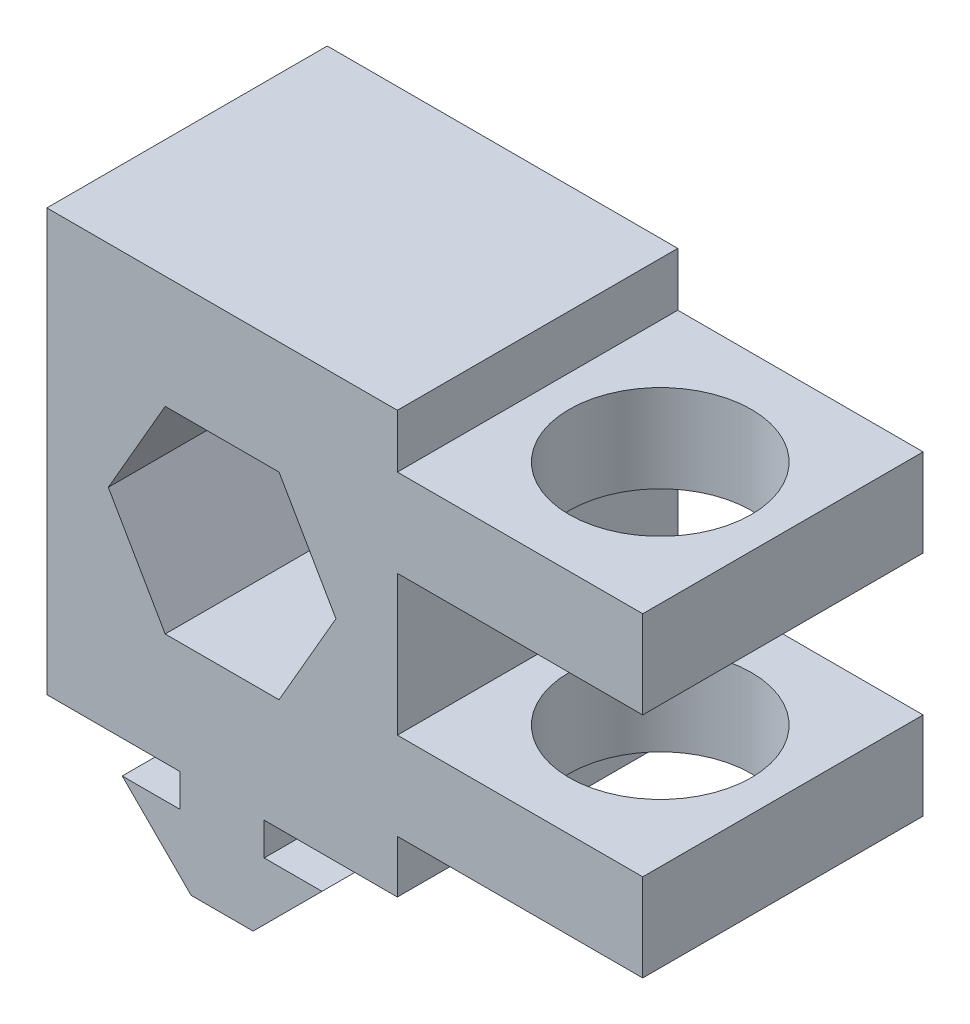
ISO-10303-21;
HEADER;
FILE_DESCRIPTION(('STEP AP214'),'2;1');
FILE_NAME('part.step','',(''),(''),'','','');
FILE_SCHEMA(('AUTOMOTIVE_DESIGN { 1 0 10303 214 1 1 1 1 }'));
ENDSEC;
DATA;
#1=APPLICATION_CONTEXT('core data for automotive mechanical design processes');
#2=APPLICATION_PROTOCOL_DEFINITION('international standard','automotive_design',2000,#1);
#3=PRODUCT_CONTEXT('',#1,'mechanical');
#4=PRODUCT('Part','Part','',(#3));
#5=PRODUCT_RELATED_PRODUCT_CATEGORY('part','',(#4));
#6=PRODUCT_DEFINITION_FORMATION('','',#4);
#7=PRODUCT_DEFINITION_CONTEXT('part definition',#1,'design');
#8=PRODUCT_DEFINITION('design','',#6,#7);
#9=PRODUCT_DEFINITION_SHAPE('','',#8);
#10=(LENGTH_UNIT() NAMED_UNIT(*) SI_UNIT(.MILLI.,.METRE.));
#11=(NAMED_UNIT(*) PLANE_ANGLE_UNIT() SI_UNIT($,.RADIAN.));
#12=(NAMED_UNIT(*) SI_UNIT($,.STERADIAN.) SOLID_ANGLE_UNIT());
#13=UNCERTAINTY_MEASURE_WITH_UNIT(LENGTH_MEASURE(1.E-05),#10,'distance_accuracy_value','');
#14=(GEOMETRIC_REPRESENTATION_CONTEXT(3) GLOBAL_UNCERTAINTY_ASSIGNED_CONTEXT((#13)) GLOBAL_UNIT_ASSIGNED_CONTEXT((#10,
#11,#12)) REPRESENTATION_CONTEXT('',''));
#15=CARTESIAN_POINT('',(0.,0.,0.));
#16=DIRECTION('',(0.,0.,1.));
#17=DIRECTION('',(1.,0.,0.));
#18=AXIS2_PLACEMENT_3D('',#15,#16,#17);
#19=CARTESIAN_POINT('',(0.,0.,10.16));
#20=DIRECTION('',(0.,0.,-1.));
#21=DIRECTION('',(-1.,0.,0.));
#22=AXIS2_PLACEMENT_3D('',#19,#20,#21);
#23=PLANE('',#22);
#24=DIRECTION('',(-1.,0.,0.));
#25=VECTOR('',#24,1.);
#26=CARTESIAN_POINT('',(7.239,4.99364,10.16));
#27=LINE('',#26,#25);
#28=CARTESIAN_POINT('',(7.239,4.99364,10.16));
#29=VERTEX_POINT('',#28);
#30=CARTESIAN_POINT('',(3.048,4.99364,10.16));
#31=VERTEX_POINT('',#30);
#32=EDGE_CURVE('E284',#29,#31,#27,.T.);
#33=ORIENTED_EDGE('',*,*,#32,.T.);
#34=DIRECTION('',(0.,1.,0.));
#35=VECTOR('',#34,1.);
#36=CARTESIAN_POINT('',(3.048,4.99364,10.16));
#37=LINE('',#36,#35);
#38=CARTESIAN_POINT('',(3.048,7.366,10.16));
#39=VERTEX_POINT('',#38);
#40=EDGE_CURVE('E288',#31,#39,#37,.T.);
#41=ORIENTED_EDGE('',*,*,#40,.T.);
#42=DIRECTION('',(1.,0.,0.));
#43=VECTOR('',#42,1.);
#44=CARTESIAN_POINT('',(3.048,7.366,10.16));
#45=LINE('',#44,#43);
#46=CARTESIAN_POINT('',(12.7,7.366,10.16));
#47=VERTEX_POINT('',#46);
#48=EDGE_CURVE('E292',#39,#47,#45,.T.);
#49=ORIENTED_EDGE('',*,*,#48,.T.);
#50=DIRECTION('',(0.,1.,0.));
#51=VECTOR('',#50,1.);
#52=CARTESIAN_POINT('',(12.7,7.366,10.16));
#53=LINE('',#52,#51);
#54=CARTESIAN_POINT('',(12.7,11.176,10.16));
#55=VERTEX_POINT('',#54);
#56=EDGE_CURVE('E295',#47,#55,#53,.T.);
#57=ORIENTED_EDGE('',*,*,#56,.T.);
#58=DIRECTION('',(1.,0.,0.));
#59=VECTOR('',#58,1.);
#60=CARTESIAN_POINT('',(30.48,11.176,10.16));
#61=LINE('',#60,#59);
#62=CARTESIAN_POINT('',(30.48,11.176,10.16));
#63=VERTEX_POINT('',#62);
#64=EDGE_CURVE('E298',#55,#63,#61,.T.);
#65=ORIENTED_EDGE('',*,*,#64,.T.);
#66=DIRECTION('',(0.,1.,0.));
#67=VECTOR('',#66,1.);
#68=CARTESIAN_POINT('',(30.48,17.526,10.16));
#69=LINE('',#68,#67);
#70=CARTESIAN_POINT('',(30.48,17.526,10.16));
#71=VERTEX_POINT('',#70);
#72=EDGE_CURVE('E301',#63,#71,#69,.T.);
#73=ORIENTED_EDGE('',*,*,#72,.T.);
#74=DIRECTION('',(-1.,0.,0.));
#75=VECTOR('',#74,1.);
#76=CARTESIAN_POINT('',(12.7,17.526,10.16));
#77=LINE('',#76,#75);
#78=CARTESIAN_POINT('',(12.7,17.526,10.16));
#79=VERTEX_POINT('',#78);
#80=EDGE_CURVE('E304',#71,#79,#77,.T.);
#81=ORIENTED_EDGE('',*,*,#80,.T.);
#82=DIRECTION('',(0.,1.,0.));
#83=VECTOR('',#82,1.);
#84=CARTESIAN_POINT('',(12.7,17.526,10.16));
#85=LINE('',#84,#83);
#86=CARTESIAN_POINT('',(12.7,27.686,10.16));
#87=VERTEX_POINT('',#86);
#88=EDGE_CURVE('E307',#79,#87,#85,.T.);
#89=ORIENTED_EDGE('',*,*,#88,.T.);
#90=DIRECTION('',(1.,0.,0.));
#91=VECTOR('',#90,1.);
#92=CARTESIAN_POINT('',(30.48,27.686,10.16));
#93=LINE('',#92,#91);
#94=CARTESIAN_POINT('',(30.48,27.686,10.16));
#95=VERTEX_POINT('',#94);
#96=EDGE_CURVE('E310',#87,#95,#93,.T.);
#97=ORIENTED_EDGE('',*,*,#96,.T.);
#98=DIRECTION('',(0.,1.,0.));
#99=VECTOR('',#98,1.);
#100=CARTESIAN_POINT('',(30.48,34.036,10.16));
#101=LINE('',#100,#99);
#102=CARTESIAN_POINT('',(30.48,34.036,10.16));
#103=VERTEX_POINT('',#102);
#104=EDGE_CURVE('E313',#95,#103,#101,.T.);
#105=ORIENTED_EDGE('',*,*,#104,.T.);
#106=DIRECTION('',(-1.,0.,0.));
#107=VECTOR('',#106,1.);
#108=CARTESIAN_POINT('',(12.7,34.036,10.16));
#109=LINE('',#108,#107);
#110=CARTESIAN_POINT('',(12.7,34.036,10.16));
#111=VERTEX_POINT('',#110);
#112=EDGE_CURVE('E316',#103,#111,#109,.T.);
#113=ORIENTED_EDGE('',*,*,#112,.T.);
#114=DIRECTION('',(0.,1.,0.));
#115=VECTOR('',#114,1.);
#116=CARTESIAN_POINT('',(12.7,34.036,10.16));
#117=LINE('',#116,#115);
#118=CARTESIAN_POINT('',(12.7,37.9165614894659,10.16));
#119=VERTEX_POINT('',#118);
#120=EDGE_CURVE('E319',#111,#119,#117,.T.);
#121=ORIENTED_EDGE('',*,*,#120,.T.);
#122=DIRECTION('',(-1.,0.,0.));
#123=VECTOR('',#122,1.);
#124=CARTESIAN_POINT('',(-12.7,37.9165614894659,10.16));
#125=LINE('',#124,#123);
#126=CARTESIAN_POINT('',(-12.7,37.9165614894659,10.16));
#127=VERTEX_POINT('',#126);
#128=EDGE_CURVE('E322',#119,#127,#125,.T.);
#129=ORIENTED_EDGE('',*,*,#128,.T.);
#130=DIRECTION('',(0.,-1.,0.));
#131=VECTOR('',#130,1.);
#132=CARTESIAN_POINT('',(-12.7,7.366,10.16));
#133=LINE('',#132,#131);
#134=CARTESIAN_POINT('',(-12.7,7.366,10.16));
#135=VERTEX_POINT('',#134);
#136=EDGE_CURVE('E325',#127,#135,#133,.T.);
#137=ORIENTED_EDGE('',*,*,#136,.T.);
#138=DIRECTION('',(1.,0.,0.));
#139=VECTOR('',#138,1.);
#140=CARTESIAN_POINT('',(-3.048,7.366,10.16));
#141=LINE('',#140,#139);
#142=CARTESIAN_POINT('',(-3.048,7.366,10.16));
#143=VERTEX_POINT('',#142);
#144=EDGE_CURVE('E328',#135,#143,#141,.T.);
#145=ORIENTED_EDGE('',*,*,#144,.T.);
#146=DIRECTION('',(0.,-1.,0.));
#147=VECTOR('',#146,1.);
#148=CARTESIAN_POINT('',(-3.048,4.99364,10.16));
#149=LINE('',#148,#147);
#150=CARTESIAN_POINT('',(-3.048,4.99364,10.16));
#151=VERTEX_POINT('',#150);
#152=EDGE_CURVE('E331',#143,#151,#149,.T.);
#153=ORIENTED_EDGE('',*,*,#152,.T.);
#154=DIRECTION('',(-1.,0.,0.));
#155=VECTOR('',#154,1.);
#156=CARTESIAN_POINT('',(-7.239,4.99364,10.16));
#157=LINE('',#156,#155);
#158=CARTESIAN_POINT('',(-7.239,4.99364,10.16));
#159=VERTEX_POINT('',#158);
#160=EDGE_CURVE('E334',#151,#159,#157,.T.);
#161=ORIENTED_EDGE('',*,*,#160,.T.);
#162=DIRECTION('',(0.707106781186546,-0.707106781186549,0.));
#163=VECTOR('',#162,1.);
#164=CARTESIAN_POINT('',(-2.24536000000001,0.,10.16));
#165=LINE('',#164,#163);
#166=CARTESIAN_POINT('',(-2.24536000000001,0.,10.16));
#167=VERTEX_POINT('',#166);
#168=EDGE_CURVE('E337',#159,#167,#165,.T.);
#169=ORIENTED_EDGE('',*,*,#168,.T.);
#170=DIRECTION('',(1.,0.,0.));
#171=VECTOR('',#170,1.);
#172=CARTESIAN_POINT('',(2.24536000000001,0.,10.16));
#173=LINE('',#172,#171);
#174=CARTESIAN_POINT('',(2.24536000000001,0.,10.16));
#175=VERTEX_POINT('',#174);
#176=EDGE_CURVE('E340',#167,#175,#173,.T.);
#177=ORIENTED_EDGE('',*,*,#176,.T.);
#178=DIRECTION('',(0.707106781186547,0.707106781186548,0.));
#179=VECTOR('',#178,1.);
#180=CARTESIAN_POINT('',(2.24536000000001,0.,10.16));
#181=LINE('',#180,#179);
#182=EDGE_CURVE('E343',#175,#29,#181,.T.);
#183=ORIENTED_EDGE('',*,*,#182,.T.);
#184=EDGE_LOOP('',(#33,#41,#49,#57,#65,#73,#81,#89,#97,#105,#113,#121,#129,#137,#145,#153,#161,
#169,#177,#183));
#185=FACE_BOUND('',#184,.T.);
#186=DIRECTION('',(-1.,0.,0.));
#187=VECTOR('',#186,1.);
#188=CARTESIAN_POINT('',(4.1244459855234,29.74975,10.16));
#189=LINE('',#188,#187);
#190=CARTESIAN_POINT('',(4.1244459855234,29.74975,10.16));
#191=VERTEX_POINT('',#190);
#192=CARTESIAN_POINT('',(-4.12444598552339,29.74975,10.16));
#193=VERTEX_POINT('',#192);
#194=EDGE_CURVE('E213',#191,#193,#189,.T.);
#195=ORIENTED_EDGE('',*,*,#194,.F.);
#196=DIRECTION('',(-0.5,0.866025403784439,0.));
#197=VECTOR('',#196,1.);
#198=CARTESIAN_POINT('',(8.24889197104678,22.606,10.16));
#199=LINE('',#198,#197);
#200=CARTESIAN_POINT('',(8.24889197104679,22.606,10.16));
#201=VERTEX_POINT('',#200);
#202=EDGE_CURVE('E249',#201,#191,#199,.T.);
#203=ORIENTED_EDGE('',*,*,#202,.F.);
#204=DIRECTION('',(0.5,0.866025403784438,0.));
#205=VECTOR('',#204,1.);
#206=CARTESIAN_POINT('',(4.12444598552339,15.46225,10.16));
#207=LINE('',#206,#205);
#208=CARTESIAN_POINT('',(4.12444598552339,15.46225,10.16));
#209=VERTEX_POINT('',#208);
#210=EDGE_CURVE('E246',#209,#201,#207,.T.);
#211=ORIENTED_EDGE('',*,*,#210,.F.);
#212=DIRECTION('',(1.,0.,0.));
#213=VECTOR('',#212,1.);
#214=CARTESIAN_POINT('',(-4.1244459855234,15.46225,10.16));
#215=LINE('',#214,#213);
#216=CARTESIAN_POINT('',(-4.1244459855234,15.46225,10.16));
#217=VERTEX_POINT('',#216);
#218=EDGE_CURVE('E240',#217,#209,#215,.T.);
#219=ORIENTED_EDGE('',*,*,#218,.F.);
#220=DIRECTION('',(0.499999999999999,-0.866025403784439,0.));
#221=VECTOR('',#220,1.);
#222=CARTESIAN_POINT('',(-8.24889197104679,22.606,10.16));
#223=LINE('',#222,#221);
#224=CARTESIAN_POINT('',(-8.24889197104679,22.606,10.16));
#225=VERTEX_POINT('',#224);
#226=EDGE_CURVE('E236',#225,#217,#223,.T.);
#227=ORIENTED_EDGE('',*,*,#226,.F.);
#228=DIRECTION('',(-0.5,-0.866025403784438,0.));
#229=VECTOR('',#228,1.);
#230=CARTESIAN_POINT('',(-4.12444598552339,29.74975,10.16));
#231=LINE('',#230,#229);
#232=EDGE_CURVE('E222',#193,#225,#231,.T.);
#233=ORIENTED_EDGE('',*,*,#232,.F.);
#234=EDGE_LOOP('',(#195,#203,#211,#219,#227,#233));
#235=FACE_BOUND('',#234,.T.);
#236=ADVANCED_FACE('F38',(#185,#235),#23,.F.);
#237=CARTESIAN_POINT('',(0.,0.,-10.16));
#238=DIRECTION('',(0.,0.,-1.));
#239=DIRECTION('',(-1.,0.,0.));
#240=AXIS2_PLACEMENT_3D('',#237,#238,#239);
#241=PLANE('',#240);
#242=DIRECTION('',(-1.,0.,0.));
#243=VECTOR('',#242,1.);
#244=CARTESIAN_POINT('',(7.239,4.99364,-10.16));
#245=LINE('',#244,#243);
#246=CARTESIAN_POINT('',(7.239,4.99364,-10.16));
#247=VERTEX_POINT('',#246);
#248=CARTESIAN_POINT('',(3.048,4.99364,-10.16));
#249=VERTEX_POINT('',#248);
#250=EDGE_CURVE('E231',#247,#249,#245,.T.);
#251=ORIENTED_EDGE('',*,*,#250,.F.);
#252=DIRECTION('',(0.707106781186547,0.707106781186548,0.));
#253=VECTOR('',#252,1.);
#254=CARTESIAN_POINT('',(2.24536000000001,0.,-10.16));
#255=LINE('',#254,#253);
#256=CARTESIAN_POINT('',(2.24536000000001,0.,-10.16));
#257=VERTEX_POINT('',#256);
#258=EDGE_CURVE('E289',#257,#247,#255,.T.);
#259=ORIENTED_EDGE('',*,*,#258,.F.);
#260=DIRECTION('',(1.,0.,0.));
#261=VECTOR('',#260,1.);
#262=CARTESIAN_POINT('',(2.24536000000001,0.,-10.16));
#263=LINE('',#262,#261);
#264=CARTESIAN_POINT('',(-2.24536000000001,0.,-10.16));
#265=VERTEX_POINT('',#264);
#266=EDGE_CURVE('E401',#265,#257,#263,.T.);
#267=ORIENTED_EDGE('',*,*,#266,.F.);
#268=DIRECTION('',(0.707106781186546,-0.707106781186549,0.));
#269=VECTOR('',#268,1.);
#270=CARTESIAN_POINT('',(-2.24536000000001,0.,-10.16));
#271=LINE('',#270,#269);
#272=CARTESIAN_POINT('',(-7.239,4.99364,-10.16));
#273=VERTEX_POINT('',#272);
#274=EDGE_CURVE('E398',#273,#265,#271,.T.);
#275=ORIENTED_EDGE('',*,*,#274,.F.);
#276=DIRECTION('',(-1.,0.,0.));
#277=VECTOR('',#276,1.);
#278=CARTESIAN_POINT('',(-7.239,4.99364,-10.16));
#279=LINE('',#278,#277);
#280=CARTESIAN_POINT('',(-3.048,4.99364,-10.16));
#281=VERTEX_POINT('',#280);
#282=EDGE_CURVE('E395',#281,#273,#279,.T.);
#283=ORIENTED_EDGE('',*,*,#282,.F.);
#284=DIRECTION('',(0.,-1.,0.));
#285=VECTOR('',#284,1.);
#286=CARTESIAN_POINT('',(-3.048,4.99364,-10.16));
#287=LINE('',#286,#285);
#288=CARTESIAN_POINT('',(-3.048,7.366,-10.16));
#289=VERTEX_POINT('',#288);
#290=EDGE_CURVE('E392',#289,#281,#287,.T.);
#291=ORIENTED_EDGE('',*,*,#290,.F.);
#292=DIRECTION('',(1.,0.,0.));
#293=VECTOR('',#292,1.);
#294=CARTESIAN_POINT('',(-3.048,7.366,-10.16));
#295=LINE('',#294,#293);
#296=CARTESIAN_POINT('',(-12.7,7.366,-10.16));
#297=VERTEX_POINT('',#296);
#298=EDGE_CURVE('E389',#297,#289,#295,.T.);
#299=ORIENTED_EDGE('',*,*,#298,.F.);
#300=DIRECTION('',(0.,-1.,0.));
#301=VECTOR('',#300,1.);
#302=CARTESIAN_POINT('',(-12.7,7.366,-10.16));
#303=LINE('',#302,#301);
#304=CARTESIAN_POINT('',(-12.7,37.9165614894659,-10.16));
#305=VERTEX_POINT('',#304);
#306=EDGE_CURVE('E386',#305,#297,#303,.T.);
#307=ORIENTED_EDGE('',*,*,#306,.F.);
#308=DIRECTION('',(-1.,0.,0.));
#309=VECTOR('',#308,1.);
#310=CARTESIAN_POINT('',(-12.7,37.9165614894659,-10.16));
#311=LINE('',#310,#309);
#312=CARTESIAN_POINT('',(12.7,37.9165614894659,-10.16));
#313=VERTEX_POINT('',#312);
#314=EDGE_CURVE('E383',#313,#305,#311,.T.);
#315=ORIENTED_EDGE('',*,*,#314,.F.);
#316=DIRECTION('',(0.,1.,0.));
#317=VECTOR('',#316,1.);
#318=CARTESIAN_POINT('',(12.7,34.036,-10.16));
#319=LINE('',#318,#317);
#320=CARTESIAN_POINT('',(12.7,34.036,-10.16));
#321=VERTEX_POINT('',#320);
#322=EDGE_CURVE('E380',#321,#313,#319,.T.);
#323=ORIENTED_EDGE('',*,*,#322,.F.);
#324=DIRECTION('',(-1.,0.,0.));
#325=VECTOR('',#324,1.);
#326=CARTESIAN_POINT('',(12.7,34.036,-10.16));
#327=LINE('',#326,#325);
#328=CARTESIAN_POINT('',(30.48,34.036,-10.16));
#329=VERTEX_POINT('',#328);
#330=EDGE_CURVE('E377',#329,#321,#327,.T.);
#331=ORIENTED_EDGE('',*,*,#330,.F.);
#332=DIRECTION('',(0.,1.,0.));
#333=VECTOR('',#332,1.);
#334=CARTESIAN_POINT('',(30.48,34.036,-10.16));
#335=LINE('',#334,#333);
#336=CARTESIAN_POINT('',(30.48,27.686,-10.16));
#337=VERTEX_POINT('',#336);
#338=EDGE_CURVE('E374',#337,#329,#335,.T.);
#339=ORIENTED_EDGE('',*,*,#338,.F.);
#340=DIRECTION('',(1.,0.,0.));
#341=VECTOR('',#340,1.);
#342=CARTESIAN_POINT('',(30.48,27.686,-10.16));
#343=LINE('',#342,#341);
#344=CARTESIAN_POINT('',(12.7,27.686,-10.16));
#345=VERTEX_POINT('',#344);
#346=EDGE_CURVE('E371',#345,#337,#343,.T.);
#347=ORIENTED_EDGE('',*,*,#346,.F.);
#348=DIRECTION('',(0.,1.,0.));
#349=VECTOR('',#348,1.);
#350=CARTESIAN_POINT('',(12.7,17.526,-10.16));
#351=LINE('',#350,#349);
#352=CARTESIAN_POINT('',(12.7,17.526,-10.16));
#353=VERTEX_POINT('',#352);
#354=EDGE_CURVE('E368',#353,#345,#351,.T.);
#355=ORIENTED_EDGE('',*,*,#354,.F.);
#356=DIRECTION('',(-1.,0.,0.));
#357=VECTOR('',#356,1.);
#358=CARTESIAN_POINT('',(12.7,17.526,-10.16));
#359=LINE('',#358,#357);
#360=CARTESIAN_POINT('',(30.48,17.526,-10.16));
#361=VERTEX_POINT('',#360);
#362=EDGE_CURVE('E365',#361,#353,#359,.T.);
#363=ORIENTED_EDGE('',*,*,#362,.F.);
#364=DIRECTION('',(0.,1.,0.));
#365=VECTOR('',#364,1.);
#366=CARTESIAN_POINT('',(30.48,17.526,-10.16));
#367=LINE('',#366,#365);
#368=CARTESIAN_POINT('',(30.48,11.176,-10.16));
#369=VERTEX_POINT('',#368);
#370=EDGE_CURVE('E362',#369,#361,#367,.T.);
#371=ORIENTED_EDGE('',*,*,#370,.F.);
#372=DIRECTION('',(1.,0.,0.));
#373=VECTOR('',#372,1.);
#374=CARTESIAN_POINT('',(30.48,11.176,-10.16));
#375=LINE('',#374,#373);
#376=CARTESIAN_POINT('',(12.7,11.176,-10.16));
#377=VERTEX_POINT('',#376);
#378=EDGE_CURVE('E359',#377,#369,#375,.T.);
#379=ORIENTED_EDGE('',*,*,#378,.F.);
#380=DIRECTION('',(0.,1.,0.));
#381=VECTOR('',#380,1.);
#382=CARTESIAN_POINT('',(12.7,7.366,-10.16));
#383=LINE('',#382,#381);
#384=CARTESIAN_POINT('',(12.7,7.366,-10.16));
#385=VERTEX_POINT('',#384);
#386=EDGE_CURVE('E356',#385,#377,#383,.T.);
#387=ORIENTED_EDGE('',*,*,#386,.F.);
#388=DIRECTION('',(1.,0.,0.));
#389=VECTOR('',#388,1.);
#390=CARTESIAN_POINT('',(3.048,7.366,-10.16));
#391=LINE('',#390,#389);
#392=CARTESIAN_POINT('',(3.048,7.366,-10.16));
#393=VERTEX_POINT('',#392);
#394=EDGE_CURVE('E353',#393,#385,#391,.T.);
#395=ORIENTED_EDGE('',*,*,#394,.F.);
#396=DIRECTION('',(0.,1.,0.));
#397=VECTOR('',#396,1.);
#398=CARTESIAN_POINT('',(3.048,4.99364,-10.16));
#399=LINE('',#398,#397);
#400=EDGE_CURVE('E350',#249,#393,#399,.T.);
#401=ORIENTED_EDGE('',*,*,#400,.F.);
#402=EDGE_LOOP('',(#251,#259,#267,#275,#283,#291,#299,#307,#315,#323,#331,#339,#347,#355,#363,
#371,#379,#387,#395,#401));
#403=FACE_BOUND('',#402,.T.);
#404=DIRECTION('',(-0.5,0.866025403784439,0.));
#405=VECTOR('',#404,1.);
#406=CARTESIAN_POINT('',(8.24889197104678,22.606,-10.16));
#407=LINE('',#406,#405);
#408=CARTESIAN_POINT('',(8.24889197104678,22.606,-10.16));
#409=VERTEX_POINT('',#408);
#410=CARTESIAN_POINT('',(4.1244459855234,29.74975,-10.16));
#411=VERTEX_POINT('',#410);
#412=EDGE_CURVE('E223',#409,#411,#407,.T.);
#413=ORIENTED_EDGE('',*,*,#412,.T.);
#414=DIRECTION('',(-1.,0.,0.));
#415=VECTOR('',#414,1.);
#416=CARTESIAN_POINT('',(4.1244459855234,29.74975,-10.16));
#417=LINE('',#416,#415);
#418=CARTESIAN_POINT('',(-4.12444598552339,29.74975,-10.16));
#419=VERTEX_POINT('',#418);
#420=EDGE_CURVE('E63',#411,#419,#417,.T.);
#421=ORIENTED_EDGE('',*,*,#420,.T.);
#422=DIRECTION('',(-0.5,-0.866025403784438,0.));
#423=VECTOR('',#422,1.);
#424=CARTESIAN_POINT('',(-4.12444598552339,29.74975,-10.16));
#425=LINE('',#424,#423);
#426=CARTESIAN_POINT('',(-8.24889197104679,22.606,-10.16));
#427=VERTEX_POINT('',#426);
#428=EDGE_CURVE('E229',#419,#427,#425,.T.);
#429=ORIENTED_EDGE('',*,*,#428,.T.);
#430=DIRECTION('',(0.499999999999999,-0.866025403784439,0.));
#431=VECTOR('',#430,1.);
#432=CARTESIAN_POINT('',(-8.24889197104679,22.606,-10.16));
#433=LINE('',#432,#431);
#434=CARTESIAN_POINT('',(-4.1244459855234,15.46225,-10.16));
#435=VERTEX_POINT('',#434);
#436=EDGE_CURVE('E257',#427,#435,#433,.T.);
#437=ORIENTED_EDGE('',*,*,#436,.T.);
#438=DIRECTION('',(1.,0.,0.));
#439=VECTOR('',#438,1.);
#440=CARTESIAN_POINT('',(-4.1244459855234,15.46225,-10.16));
#441=LINE('',#440,#439);
#442=CARTESIAN_POINT('',(4.12444598552339,15.46225,-10.16));
#443=VERTEX_POINT('',#442);
#444=EDGE_CURVE('E261',#435,#443,#441,.T.);
#445=ORIENTED_EDGE('',*,*,#444,.T.);
#446=DIRECTION('',(0.5,0.866025403784438,0.));
#447=VECTOR('',#446,1.);
#448=CARTESIAN_POINT('',(4.12444598552339,15.46225,-10.16));
#449=LINE('',#448,#447);
#450=EDGE_CURVE('E265',#443,#409,#449,.T.);
#451=ORIENTED_EDGE('',*,*,#450,.T.);
#452=EDGE_LOOP('',(#413,#421,#429,#437,#445,#451));
#453=FACE_BOUND('',#452,.T.);
#454=ADVANCED_FACE('F489',(#403,#453),#241,.T.);
#455=CARTESIAN_POINT('',(7.239,4.99364,10.16));
#456=DIRECTION('',(0.,-1.,0.));
#457=DIRECTION('',(1.,0.,0.));
#458=AXIS2_PLACEMENT_3D('',#455,#456,#457);
#459=PLANE('',#458);
#460=ORIENTED_EDGE('',*,*,#250,.T.);
#461=DIRECTION('',(0.,0.,-1.));
#462=VECTOR('',#461,1.);
#463=CARTESIAN_POINT('',(3.048,4.99364,10.16));
#464=LINE('',#463,#462);
#465=EDGE_CURVE('E11',#31,#249,#464,.T.);
#466=ORIENTED_EDGE('',*,*,#465,.F.);
#467=ORIENTED_EDGE('',*,*,#32,.F.);
#468=DIRECTION('',(0.,0.,-1.));
#469=VECTOR('',#468,1.);
#470=CARTESIAN_POINT('',(7.239,4.99364,10.16));
#471=LINE('',#470,#469);
#472=EDGE_CURVE('E346',#29,#247,#471,.T.);
#473=ORIENTED_EDGE('',*,*,#472,.T.);
#474=EDGE_LOOP('',(#460,#466,#467,#473));
#475=FACE_BOUND('',#474,.T.);
#476=ADVANCED_FACE('F40',(#475),#459,.F.);
#477=CARTESIAN_POINT('',(3.048,4.99364,10.16));
#478=DIRECTION('',(-1.,0.,0.));
#479=DIRECTION('',(0.,0.,1.));
#480=AXIS2_PLACEMENT_3D('',#477,#478,#479);
#481=PLANE('',#480);
#482=ORIENTED_EDGE('',*,*,#400,.T.);
#483=DIRECTION('',(0.,0.,-1.));
#484=VECTOR('',#483,1.);
#485=CARTESIAN_POINT('',(3.048,7.366,10.16));
#486=LINE('',#485,#484);
#487=EDGE_CURVE('E48',#39,#393,#486,.T.);
#488=ORIENTED_EDGE('',*,*,#487,.F.);
#489=ORIENTED_EDGE('',*,*,#40,.F.);
#490=ORIENTED_EDGE('',*,*,#465,.T.);
#491=EDGE_LOOP('',(#482,#488,#489,#490));
#492=FACE_BOUND('',#491,.T.);
#493=ADVANCED_FACE('F506',(#492),#481,.F.);
#494=CARTESIAN_POINT('',(3.048,7.366,10.16));
#495=DIRECTION('',(0.,1.,0.));
#496=DIRECTION('',(-1.,0.,0.));
#497=AXIS2_PLACEMENT_3D('',#494,#495,#496);
#498=PLANE('',#497);
#499=ORIENTED_EDGE('',*,*,#394,.T.);
#500=DIRECTION('',(0.,0.,-1.));
#501=VECTOR('',#500,1.);
#502=CARTESIAN_POINT('',(12.7,7.366,10.16));
#503=LINE('',#502,#501);
#504=EDGE_CURVE('E473',#47,#385,#503,.T.);
#505=ORIENTED_EDGE('',*,*,#504,.F.);
#506=ORIENTED_EDGE('',*,*,#48,.F.);
#507=ORIENTED_EDGE('',*,*,#487,.T.);
#508=EDGE_LOOP('',(#499,#505,#506,#507));
#509=FACE_BOUND('',#508,.T.);
#510=ADVANCED_FACE('F483',(#509),#498,.F.);
#511=CARTESIAN_POINT('',(12.7,7.366,10.16));
#512=DIRECTION('',(-1.,0.,0.));
#513=DIRECTION('',(0.,-1.,0.));
#514=AXIS2_PLACEMENT_3D('',#511,#512,#513);
#515=PLANE('',#514);
#516=ORIENTED_EDGE('',*,*,#386,.T.);
#517=DIRECTION('',(0.,0.,-1.));
#518=VECTOR('',#517,1.);
#519=CARTESIAN_POINT('',(12.7,11.176,10.16));
#520=LINE('',#519,#518);
#521=EDGE_CURVE('E469',#55,#377,#520,.T.);
#522=ORIENTED_EDGE('',*,*,#521,.F.);
#523=ORIENTED_EDGE('',*,*,#56,.F.);
#524=ORIENTED_EDGE('',*,*,#504,.T.);
#525=EDGE_LOOP('',(#516,#522,#523,#524));
#526=FACE_BOUND('',#525,.T.);
#527=ADVANCED_FACE('F495',(#526),#515,.F.);
#528=CARTESIAN_POINT('',(30.48,11.176,10.16));
#529=DIRECTION('',(0.,1.,0.));
#530=DIRECTION('',(-1.,0.,0.));
#531=AXIS2_PLACEMENT_3D('',#528,#529,#530);
#532=PLANE('',#531);
#533=CARTESIAN_POINT('',(21.59,11.176,0.));
#534=DIRECTION('',(0.,1.,0.));
#535=DIRECTION('',(-1.,0.,0.));
#536=AXIS2_PLACEMENT_3D('',#533,#534,#535);
#537=CIRCLE('',#536,6.604);
#538=CARTESIAN_POINT('',(14.986,11.176,0.));
#539=VERTEX_POINT('',#538);
#540=EDGE_CURVE('E254',#539,#539,#537,.T.);
#541=ORIENTED_EDGE('',*,*,#540,.T.);
#542=EDGE_LOOP('',(#541));
#543=FACE_BOUND('',#542,.T.);
#544=ORIENTED_EDGE('',*,*,#378,.T.);
#545=DIRECTION('',(0.,0.,-1.));
#546=VECTOR('',#545,1.);
#547=CARTESIAN_POINT('',(30.48,11.176,10.16));
#548=LINE('',#547,#546);
#549=EDGE_CURVE('E465',#63,#369,#548,.T.);
#550=ORIENTED_EDGE('',*,*,#549,.F.);
#551=ORIENTED_EDGE('',*,*,#64,.F.);
#552=ORIENTED_EDGE('',*,*,#521,.T.);
#553=EDGE_LOOP('',(#544,#550,#551,#552));
#554=FACE_BOUND('',#553,.T.);
#555=ADVANCED_FACE('F499',(#543,#554),#532,.F.);
#556=CARTESIAN_POINT('',(30.48,17.526,10.16));
#557=DIRECTION('',(-1.,0.,0.));
#558=DIRECTION('',(0.,-1.,0.));
#559=AXIS2_PLACEMENT_3D('',#556,#557,#558);
#560=PLANE('',#559);
#561=ORIENTED_EDGE('',*,*,#370,.T.);
#562=DIRECTION('',(0.,0.,-1.));
#563=VECTOR('',#562,1.);
#564=CARTESIAN_POINT('',(30.48,17.526,10.16));
#565=LINE('',#564,#563);
#566=EDGE_CURVE('E461',#71,#361,#565,.T.);
#567=ORIENTED_EDGE('',*,*,#566,.F.);
#568=ORIENTED_EDGE('',*,*,#72,.F.);
#569=ORIENTED_EDGE('',*,*,#549,.T.);
#570=EDGE_LOOP('',(#561,#567,#568,#569));
#571=FACE_BOUND('',#570,.T.);
#572=ADVANCED_FACE('F579',(#571),#560,.F.);
#573=CARTESIAN_POINT('',(12.7,17.526,10.16));
#574=DIRECTION('',(0.,-1.,0.));
#575=DIRECTION('',(0.,0.,-1.));
#576=AXIS2_PLACEMENT_3D('',#573,#574,#575);
#577=PLANE('',#576);
#578=CARTESIAN_POINT('',(21.59,17.526,0.));
#579=DIRECTION('',(0.,-1.,0.));
#580=DIRECTION('',(0.,0.,-1.));
#581=AXIS2_PLACEMENT_3D('',#578,#579,#580);
#582=CIRCLE('',#581,6.604);
#583=CARTESIAN_POINT('',(21.59,17.526,-6.604));
#584=VERTEX_POINT('',#583);
#585=EDGE_CURVE('E835',#584,#584,#582,.T.);
#586=ORIENTED_EDGE('',*,*,#585,.T.);
#587=EDGE_LOOP('',(#586));
#588=FACE_BOUND('',#587,.T.);
#589=ORIENTED_EDGE('',*,*,#362,.T.);
#590=DIRECTION('',(0.,0.,-1.));
#591=VECTOR('',#590,1.);
#592=CARTESIAN_POINT('',(12.7,17.526,10.16));
#593=LINE('',#592,#591);
#594=EDGE_CURVE('E457',#79,#353,#593,.T.);
#595=ORIENTED_EDGE('',*,*,#594,.F.);
#596=ORIENTED_EDGE('',*,*,#80,.F.);
#597=ORIENTED_EDGE('',*,*,#566,.T.);
#598=EDGE_LOOP('',(#589,#595,#596,#597));
#599=FACE_BOUND('',#598,.T.);
#600=ADVANCED_FACE('F577',(#588,#599),#577,.F.);
#601=CARTESIAN_POINT('',(12.7,17.526,10.16));
#602=DIRECTION('',(-1.,0.,0.));
#603=DIRECTION('',(0.,0.,1.));
#604=AXIS2_PLACEMENT_3D('',#601,#602,#603);
#605=PLANE('',#604);
#606=ORIENTED_EDGE('',*,*,#354,.T.);
#607=DIRECTION('',(0.,0.,-1.));
#608=VECTOR('',#607,1.);
#609=CARTESIAN_POINT('',(12.7,27.686,10.16));
#610=LINE('',#609,#608);
#611=EDGE_CURVE('E453',#87,#345,#610,.T.);
#612=ORIENTED_EDGE('',*,*,#611,.F.);
#613=ORIENTED_EDGE('',*,*,#88,.F.);
#614=ORIENTED_EDGE('',*,*,#594,.T.);
#615=EDGE_LOOP('',(#606,#612,#613,#614));
#616=FACE_BOUND('',#615,.T.);
#617=ADVANCED_FACE('F572',(#616),#605,.F.);
#618=CARTESIAN_POINT('',(30.48,27.686,10.16));
#619=DIRECTION('',(0.,1.,0.));
#620=DIRECTION('',(-1.,0.,0.));
#621=AXIS2_PLACEMENT_3D('',#618,#619,#620);
#622=PLANE('',#621);
#623=CARTESIAN_POINT('',(21.59,27.686,0.));
#624=DIRECTION('',(0.,1.,0.));
#625=DIRECTION('',(-1.,0.,0.));
#626=AXIS2_PLACEMENT_3D('',#623,#624,#625);
#627=CIRCLE('',#626,6.604);
#628=CARTESIAN_POINT('',(14.986,27.686,0.));
#629=VERTEX_POINT('',#628);
#630=EDGE_CURVE('E840',#629,#629,#627,.T.);
#631=ORIENTED_EDGE('',*,*,#630,.T.);
#632=EDGE_LOOP('',(#631));
#633=FACE_BOUND('',#632,.T.);
#634=ORIENTED_EDGE('',*,*,#346,.T.);
#635=DIRECTION('',(0.,0.,-1.));
#636=VECTOR('',#635,1.);
#637=CARTESIAN_POINT('',(30.48,27.686,10.16));
#638=LINE('',#637,#636);
#639=EDGE_CURVE('E449',#95,#337,#638,.T.);
#640=ORIENTED_EDGE('',*,*,#639,.F.);
#641=ORIENTED_EDGE('',*,*,#96,.F.);
#642=ORIENTED_EDGE('',*,*,#611,.T.);
#643=EDGE_LOOP('',(#634,#640,#641,#642));
#644=FACE_BOUND('',#643,.T.);
#645=ADVANCED_FACE('F567',(#633,#644),#622,.F.);
#646=CARTESIAN_POINT('',(30.48,34.036,10.16));
#647=DIRECTION('',(-1.,0.,0.));
#648=DIRECTION('',(0.,0.,1.));
#649=AXIS2_PLACEMENT_3D('',#646,#647,#648);
#650=PLANE('',#649);
#651=ORIENTED_EDGE('',*,*,#338,.T.);
#652=DIRECTION('',(0.,0.,-1.));
#653=VECTOR('',#652,1.);
#654=CARTESIAN_POINT('',(30.48,34.036,10.16));
#655=LINE('',#654,#653);
#656=EDGE_CURVE('E445',#103,#329,#655,.T.);
#657=ORIENTED_EDGE('',*,*,#656,.F.);
#658=ORIENTED_EDGE('',*,*,#104,.F.);
#659=ORIENTED_EDGE('',*,*,#639,.T.);
#660=EDGE_LOOP('',(#651,#657,#658,#659));
#661=FACE_BOUND('',#660,.T.);
#662=ADVANCED_FACE('F563',(#661),#650,.F.);
#663=CARTESIAN_POINT('',(12.7,34.036,10.16));
#664=DIRECTION('',(0.,-1.,0.));
#665=DIRECTION('',(1.,0.,0.));
#666=AXIS2_PLACEMENT_3D('',#663,#664,#665);
#667=PLANE('',#666);
#668=CARTESIAN_POINT('',(21.59,34.036,0.));
#669=DIRECTION('',(0.,-1.,0.));
#670=DIRECTION('',(1.,0.,0.));
#671=AXIS2_PLACEMENT_3D('',#668,#669,#670);
#672=CIRCLE('',#671,6.604);
#673=CARTESIAN_POINT('',(28.194,34.036,0.));
#674=VERTEX_POINT('',#673);
#675=EDGE_CURVE('E42',#674,#674,#672,.T.);
#676=ORIENTED_EDGE('',*,*,#675,.T.);
#677=EDGE_LOOP('',(#676));
#678=FACE_BOUND('',#677,.T.);
#679=ORIENTED_EDGE('',*,*,#330,.T.);
#680=DIRECTION('',(0.,0.,-1.));
#681=VECTOR('',#680,1.);
#682=CARTESIAN_POINT('',(12.7,34.036,10.16));
#683=LINE('',#682,#681);
#684=EDGE_CURVE('E441',#111,#321,#683,.T.);
#685=ORIENTED_EDGE('',*,*,#684,.F.);
#686=ORIENTED_EDGE('',*,*,#112,.F.);
#687=ORIENTED_EDGE('',*,*,#656,.T.);
#688=EDGE_LOOP('',(#679,#685,#686,#687));
#689=FACE_BOUND('',#688,.T.);
#690=ADVANCED_FACE('F558',(#678,#689),#667,.F.);
#691=CARTESIAN_POINT('',(12.7,34.036,10.16));
#692=DIRECTION('',(-1.,0.,0.));
#693=DIRECTION('',(0.,0.,1.));
#694=AXIS2_PLACEMENT_3D('',#691,#692,#693);
#695=PLANE('',#694);
#696=ORIENTED_EDGE('',*,*,#322,.T.);
#697=DIRECTION('',(0.,0.,-1.));
#698=VECTOR('',#697,1.);
#699=CARTESIAN_POINT('',(12.7,37.9165614894659,10.16));
#700=LINE('',#699,#698);
#701=EDGE_CURVE('E437',#119,#313,#700,.T.);
#702=ORIENTED_EDGE('',*,*,#701,.F.);
#703=ORIENTED_EDGE('',*,*,#120,.F.);
#704=ORIENTED_EDGE('',*,*,#684,.T.);
#705=EDGE_LOOP('',(#696,#702,#703,#704));
#706=FACE_BOUND('',#705,.T.);
#707=ADVANCED_FACE('F552',(#706),#695,.F.);
#708=CARTESIAN_POINT('',(-12.7,37.9165614894659,10.16));
#709=DIRECTION('',(0.,-1.,0.));
#710=DIRECTION('',(0.,0.,-1.));
#711=AXIS2_PLACEMENT_3D('',#708,#709,#710);
#712=PLANE('',#711);
#713=ORIENTED_EDGE('',*,*,#314,.T.);
#714=DIRECTION('',(0.,0.,-1.));
#715=VECTOR('',#714,1.);
#716=CARTESIAN_POINT('',(-12.7,37.9165614894659,10.16));
#717=LINE('',#716,#715);
#718=EDGE_CURVE('E433',#127,#305,#717,.T.);
#719=ORIENTED_EDGE('',*,*,#718,.F.);
#720=ORIENTED_EDGE('',*,*,#128,.F.);
#721=ORIENTED_EDGE('',*,*,#701,.T.);
#722=EDGE_LOOP('',(#713,#719,#720,#721));
#723=FACE_BOUND('',#722,.T.);
#724=ADVANCED_FACE('F548',(#723),#712,.F.);
#725=CARTESIAN_POINT('',(-12.7,7.366,10.16));
#726=DIRECTION('',(1.,0.,0.));
#727=DIRECTION('',(0.,0.,-1.));
#728=AXIS2_PLACEMENT_3D('',#725,#726,#727);
#729=PLANE('',#728);
#730=ORIENTED_EDGE('',*,*,#306,.T.);
#731=DIRECTION('',(0.,0.,-1.));
#732=VECTOR('',#731,1.);
#733=CARTESIAN_POINT('',(-12.7,7.366,10.16));
#734=LINE('',#733,#732);
#735=EDGE_CURVE('E429',#135,#297,#734,.T.);
#736=ORIENTED_EDGE('',*,*,#735,.F.);
#737=ORIENTED_EDGE('',*,*,#136,.F.);
#738=ORIENTED_EDGE('',*,*,#718,.T.);
#739=EDGE_LOOP('',(#730,#736,#737,#738));
#740=FACE_BOUND('',#739,.T.);
#741=ADVANCED_FACE('F543',(#740),#729,.F.);
#742=CARTESIAN_POINT('',(-3.048,7.366,10.16));
#743=DIRECTION('',(0.,1.,0.));
#744=DIRECTION('',(-1.,0.,0.));
#745=AXIS2_PLACEMENT_3D('',#742,#743,#744);
#746=PLANE('',#745);
#747=ORIENTED_EDGE('',*,*,#298,.T.);
#748=DIRECTION('',(0.,0.,-1.));
#749=VECTOR('',#748,1.);
#750=CARTESIAN_POINT('',(-3.048,7.366,10.16));
#751=LINE('',#750,#749);
#752=EDGE_CURVE('E425',#143,#289,#751,.T.);
#753=ORIENTED_EDGE('',*,*,#752,.F.);
#754=ORIENTED_EDGE('',*,*,#144,.F.);
#755=ORIENTED_EDGE('',*,*,#735,.T.);
#756=EDGE_LOOP('',(#747,#753,#754,#755));
#757=FACE_BOUND('',#756,.T.);
#758=ADVANCED_FACE('F537',(#757),#746,.F.);
#759=CARTESIAN_POINT('',(-3.048,4.99364,10.16));
#760=DIRECTION('',(1.,0.,0.));
#761=DIRECTION('',(0.,0.,-1.));
#762=AXIS2_PLACEMENT_3D('',#759,#760,#761);
#763=PLANE('',#762);
#764=ORIENTED_EDGE('',*,*,#290,.T.);
#765=DIRECTION('',(0.,0.,-1.));
#766=VECTOR('',#765,1.);
#767=CARTESIAN_POINT('',(-3.048,4.99364,10.16));
#768=LINE('',#767,#766);
#769=EDGE_CURVE('E421',#151,#281,#768,.T.);
#770=ORIENTED_EDGE('',*,*,#769,.F.);
#771=ORIENTED_EDGE('',*,*,#152,.F.);
#772=ORIENTED_EDGE('',*,*,#752,.T.);
#773=EDGE_LOOP('',(#764,#770,#771,#772));
#774=FACE_BOUND('',#773,.T.);
#775=ADVANCED_FACE('F533',(#774),#763,.F.);
#776=CARTESIAN_POINT('',(-7.239,4.99364,10.16));
#777=DIRECTION('',(0.,-1.,0.));
#778=DIRECTION('',(1.,0.,0.));
#779=AXIS2_PLACEMENT_3D('',#776,#777,#778);
#780=PLANE('',#779);
#781=ORIENTED_EDGE('',*,*,#282,.T.);
#782=DIRECTION('',(0.,0.,-1.));
#783=VECTOR('',#782,1.);
#784=CARTESIAN_POINT('',(-7.239,4.99364,10.16));
#785=LINE('',#784,#783);
#786=EDGE_CURVE('E417',#159,#273,#785,.T.);
#787=ORIENTED_EDGE('',*,*,#786,.F.);
#788=ORIENTED_EDGE('',*,*,#160,.F.);
#789=ORIENTED_EDGE('',*,*,#769,.T.);
#790=EDGE_LOOP('',(#781,#787,#788,#789));
#791=FACE_BOUND('',#790,.T.);
#792=ADVANCED_FACE('F528',(#791),#780,.F.);
#793=CARTESIAN_POINT('',(-2.24536000000001,0.,10.16));
#794=DIRECTION('',(0.707106781186548,0.707106781186546,0.));
#795=DIRECTION('',(-0.707106781186547,0.707106781186549,0.));
#796=AXIS2_PLACEMENT_3D('',#793,#794,#795);
#797=PLANE('',#796);
#798=ORIENTED_EDGE('',*,*,#274,.T.);
#799=DIRECTION('',(0.,0.,-1.));
#800=VECTOR('',#799,1.);
#801=CARTESIAN_POINT('',(-2.24536000000001,0.,10.16));
#802=LINE('',#801,#800);
#803=EDGE_CURVE('E413',#167,#265,#802,.T.);
#804=ORIENTED_EDGE('',*,*,#803,.F.);
#805=ORIENTED_EDGE('',*,*,#168,.F.);
#806=ORIENTED_EDGE('',*,*,#786,.T.);
#807=EDGE_LOOP('',(#798,#804,#805,#806));
#808=FACE_BOUND('',#807,.T.);
#809=ADVANCED_FACE('F522',(#808),#797,.F.);
#810=CARTESIAN_POINT('',(2.24536000000001,0.,10.16));
#811=DIRECTION('',(0.,1.,0.));
#812=DIRECTION('',(-1.,0.,0.));
#813=AXIS2_PLACEMENT_3D('',#810,#811,#812);
#814=PLANE('',#813);
#815=ORIENTED_EDGE('',*,*,#266,.T.);
#816=DIRECTION('',(0.,0.,-1.));
#817=VECTOR('',#816,1.);
#818=CARTESIAN_POINT('',(2.24536000000001,0.,10.16));
#819=LINE('',#818,#817);
#820=EDGE_CURVE('E409',#175,#257,#819,.T.);
#821=ORIENTED_EDGE('',*,*,#820,.F.);
#822=ORIENTED_EDGE('',*,*,#176,.F.);
#823=ORIENTED_EDGE('',*,*,#803,.T.);
#824=EDGE_LOOP('',(#815,#821,#822,#823));
#825=FACE_BOUND('',#824,.T.);
#826=ADVANCED_FACE('F518',(#825),#814,.F.);
#827=CARTESIAN_POINT('',(2.24536000000001,0.,10.16));
#828=DIRECTION('',(-0.707106781186548,0.707106781186547,0.));
#829=DIRECTION('',(-0.707106781186547,-0.707106781186548,0.));
#830=AXIS2_PLACEMENT_3D('',#827,#828,#829);
#831=PLANE('',#830);
#832=ORIENTED_EDGE('',*,*,#258,.T.);
#833=ORIENTED_EDGE('',*,*,#472,.F.);
#834=ORIENTED_EDGE('',*,*,#182,.F.);
#835=ORIENTED_EDGE('',*,*,#820,.T.);
#836=EDGE_LOOP('',(#832,#833,#834,#835));
#837=FACE_BOUND('',#836,.T.);
#838=ADVANCED_FACE('F513',(#837),#831,.F.);
#839=CARTESIAN_POINT('',(4.1244459855234,29.74975,10.16));
#840=DIRECTION('',(0.,-1.,0.));
#841=DIRECTION('',(1.,0.,0.));
#842=AXIS2_PLACEMENT_3D('',#839,#840,#841);
#843=PLANE('',#842);
#844=ORIENTED_EDGE('',*,*,#420,.F.);
#845=DIRECTION('',(0.,0.,-1.));
#846=VECTOR('',#845,1.);
#847=CARTESIAN_POINT('',(4.1244459855234,29.74975,10.16));
#848=LINE('',#847,#846);
#849=EDGE_CURVE('E217',#191,#411,#848,.T.);
#850=ORIENTED_EDGE('',*,*,#849,.F.);
#851=ORIENTED_EDGE('',*,*,#194,.T.);
#852=DIRECTION('',(0.,0.,-1.));
#853=VECTOR('',#852,1.);
#854=CARTESIAN_POINT('',(-4.12444598552339,29.74975,10.16));
#855=LINE('',#854,#853);
#856=EDGE_CURVE('E216',#193,#419,#855,.T.);
#857=ORIENTED_EDGE('',*,*,#856,.T.);
#858=EDGE_LOOP('',(#844,#850,#851,#857));
#859=FACE_BOUND('',#858,.T.);
#860=ADVANCED_FACE('F215',(#859),#843,.T.);
#861=CARTESIAN_POINT('',(-4.12444598552339,29.74975,10.16));
#862=DIRECTION('',(0.866025403784438,-0.5,0.));
#863=DIRECTION('',(0.5,0.866025403784438,0.));
#864=AXIS2_PLACEMENT_3D('',#861,#862,#863);
#865=PLANE('',#864);
#866=ORIENTED_EDGE('',*,*,#428,.F.);
#867=ORIENTED_EDGE('',*,*,#856,.F.);
#868=ORIENTED_EDGE('',*,*,#232,.T.);
#869=DIRECTION('',(0.,0.,-1.));
#870=VECTOR('',#869,1.);
#871=CARTESIAN_POINT('',(-8.24889197104679,22.606,10.16));
#872=LINE('',#871,#870);
#873=EDGE_CURVE('E232',#225,#427,#872,.T.);
#874=ORIENTED_EDGE('',*,*,#873,.T.);
#875=EDGE_LOOP('',(#866,#867,#868,#874));
#876=FACE_BOUND('',#875,.T.);
#877=ADVANCED_FACE('F226',(#876),#865,.T.);
#878=CARTESIAN_POINT('',(-8.24889197104679,22.606,10.16));
#879=DIRECTION('',(0.866025403784439,0.499999999999999,0.));
#880=DIRECTION('',(-0.5,0.866025403784439,0.));
#881=AXIS2_PLACEMENT_3D('',#878,#879,#880);
#882=PLANE('',#881);
#883=ORIENTED_EDGE('',*,*,#436,.F.);
#884=ORIENTED_EDGE('',*,*,#873,.F.);
#885=ORIENTED_EDGE('',*,*,#226,.T.);
#886=DIRECTION('',(0.,0.,-1.));
#887=VECTOR('',#886,1.);
#888=CARTESIAN_POINT('',(-4.1244459855234,15.46225,10.16));
#889=LINE('',#888,#887);
#890=EDGE_CURVE('E279',#217,#435,#889,.T.);
#891=ORIENTED_EDGE('',*,*,#890,.T.);
#892=EDGE_LOOP('',(#883,#884,#885,#891));
#893=FACE_BOUND('',#892,.T.);
#894=ADVANCED_FACE('F690',(#893),#882,.T.);
#895=CARTESIAN_POINT('',(-4.1244459855234,15.46225,10.16));
#896=DIRECTION('',(0.,1.,0.));
#897=DIRECTION('',(0.,0.,1.));
#898=AXIS2_PLACEMENT_3D('',#895,#896,#897);
#899=PLANE('',#898);
#900=ORIENTED_EDGE('',*,*,#444,.F.);
#901=ORIENTED_EDGE('',*,*,#890,.F.);
#902=ORIENTED_EDGE('',*,*,#218,.T.);
#903=DIRECTION('',(0.,0.,-1.));
#904=VECTOR('',#903,1.);
#905=CARTESIAN_POINT('',(4.12444598552339,15.46225,10.16));
#906=LINE('',#905,#904);
#907=EDGE_CURVE('E276',#209,#443,#906,.T.);
#908=ORIENTED_EDGE('',*,*,#907,.T.);
#909=EDGE_LOOP('',(#900,#901,#902,#908));
#910=FACE_BOUND('',#909,.T.);
#911=ADVANCED_FACE('F696',(#910),#899,.T.);
#912=CARTESIAN_POINT('',(4.12444598552339,15.46225,10.16));
#913=DIRECTION('',(-0.866025403784438,0.5,0.));
#914=DIRECTION('',(-0.5,-0.866025403784438,0.));
#915=AXIS2_PLACEMENT_3D('',#912,#913,#914);
#916=PLANE('',#915);
#917=ORIENTED_EDGE('',*,*,#450,.F.);
#918=ORIENTED_EDGE('',*,*,#907,.F.);
#919=ORIENTED_EDGE('',*,*,#210,.T.);
#920=DIRECTION('',(0.,0.,-1.));
#921=VECTOR('',#920,1.);
#922=CARTESIAN_POINT('',(8.24889197104678,22.606,10.16));
#923=LINE('',#922,#921);
#924=EDGE_CURVE('E55',#201,#409,#923,.T.);
#925=ORIENTED_EDGE('',*,*,#924,.T.);
#926=EDGE_LOOP('',(#917,#918,#919,#925));
#927=FACE_BOUND('',#926,.T.);
#928=ADVANCED_FACE('F704',(#927),#916,.T.);
#929=CARTESIAN_POINT('',(8.24889197104678,22.606,10.16));
#930=DIRECTION('',(-0.866025403784439,-0.5,0.));
#931=DIRECTION('',(0.5,-0.866025403784439,0.));
#932=AXIS2_PLACEMENT_3D('',#929,#930,#931);
#933=PLANE('',#932);
#934=ORIENTED_EDGE('',*,*,#412,.F.);
#935=ORIENTED_EDGE('',*,*,#924,.F.);
#936=ORIENTED_EDGE('',*,*,#202,.T.);
#937=ORIENTED_EDGE('',*,*,#849,.T.);
#938=EDGE_LOOP('',(#934,#935,#936,#937));
#939=FACE_BOUND('',#938,.T.);
#940=ADVANCED_FACE('F712',(#939),#933,.T.);
#941=CARTESIAN_POINT('',(21.59,0.,0.));
#942=DIRECTION('',(0.,1.,0.));
#943=DIRECTION('',(0.,0.,1.));
#944=AXIS2_PLACEMENT_3D('',#941,#942,#943);
#945=CYLINDRICAL_SURFACE('',#944,6.604);
#946=ORIENTED_EDGE('',*,*,#675,.F.);
#947=EDGE_LOOP('',(#946));
#948=FACE_BOUND('',#947,.T.);
#949=ORIENTED_EDGE('',*,*,#630,.F.);
#950=EDGE_LOOP('',(#949));
#951=FACE_BOUND('',#950,.T.);
#952=ADVANCED_FACE('F720',(#948,#951),#945,.F.);
#953=ORIENTED_EDGE('',*,*,#585,.F.);
#954=EDGE_LOOP('',(#953));
#955=FACE_BOUND('',#954,.T.);
#956=ORIENTED_EDGE('',*,*,#540,.F.);
#957=EDGE_LOOP('',(#956));
#958=FACE_BOUND('',#957,.T.);
#959=ADVANCED_FACE('F727',(#955,#958),#945,.F.);
#960=CLOSED_SHELL('',(#236,#454,#476,#493,#510,#527,#555,#572,#600,#617,#645,#662,#690,#707,
#724,#741,#758,#775,#792,#809,#826,#838,#860,#877,#894,#911,#928,#940,#952,#959));
#961=MANIFOLD_SOLID_BREP('B2',#960);
#962=ADVANCED_BREP_SHAPE_REPRESENTATION('',(#18,#961),#14);
#963=SHAPE_DEFINITION_REPRESENTATION(#9,#962);
ENDSEC;
END-ISO-10303-21;
